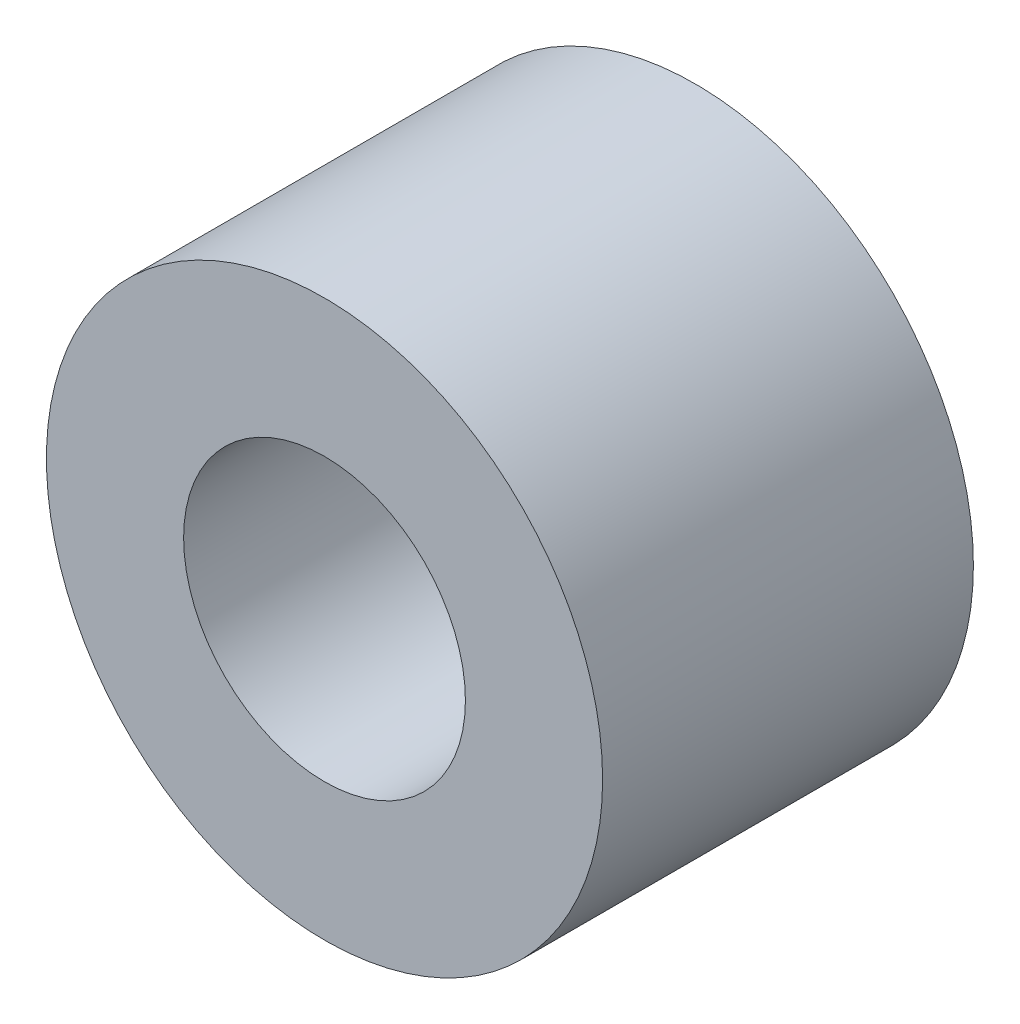
ISO-10303-21;
HEADER;
FILE_DESCRIPTION(('STEP AP214'),'2;1');
FILE_NAME('part.step','',(''),(''),'','','');
FILE_SCHEMA(('AUTOMOTIVE_DESIGN { 1 0 10303 214 1 1 1 1 }'));
ENDSEC;
DATA;
#1=APPLICATION_CONTEXT('core data for automotive mechanical design processes');
#2=APPLICATION_PROTOCOL_DEFINITION('international standard','automotive_design',2000,#1);
#3=PRODUCT_CONTEXT('',#1,'mechanical');
#4=PRODUCT('Part','Part','',(#3));
#5=PRODUCT_RELATED_PRODUCT_CATEGORY('part','',(#4));
#6=PRODUCT_DEFINITION_FORMATION('','',#4);
#7=PRODUCT_DEFINITION_CONTEXT('part definition',#1,'design');
#8=PRODUCT_DEFINITION('design','',#6,#7);
#9=PRODUCT_DEFINITION_SHAPE('','',#8);
#10=(LENGTH_UNIT() NAMED_UNIT(*) SI_UNIT(.MILLI.,.METRE.));
#11=(NAMED_UNIT(*) PLANE_ANGLE_UNIT() SI_UNIT($,.RADIAN.));
#12=(NAMED_UNIT(*) SI_UNIT($,.STERADIAN.) SOLID_ANGLE_UNIT());
#13=UNCERTAINTY_MEASURE_WITH_UNIT(LENGTH_MEASURE(1.E-05),#10,'distance_accuracy_value','');
#14=(GEOMETRIC_REPRESENTATION_CONTEXT(3) GLOBAL_UNCERTAINTY_ASSIGNED_CONTEXT((#13)) GLOBAL_UNIT_ASSIGNED_CONTEXT((#10,
#11,#12)) REPRESENTATION_CONTEXT('',''));
#15=CARTESIAN_POINT('',(0.,0.,0.));
#16=DIRECTION('',(0.,0.,1.));
#17=DIRECTION('',(1.,0.,0.));
#18=AXIS2_PLACEMENT_3D('',#15,#16,#17);
#19=CARTESIAN_POINT('',(0.,0.,6.35));
#20=DIRECTION('',(0.,0.,1.));
#21=DIRECTION('',(1.,0.,0.));
#22=AXIS2_PLACEMENT_3D('',#19,#20,#21);
#23=PLANE('',#22);
#24=CARTESIAN_POINT('',(0.,0.,6.35));
#25=DIRECTION('',(0.,0.,1.));
#26=DIRECTION('',(1.,0.,0.));
#27=AXIS2_PLACEMENT_3D('',#24,#25,#26);
#28=CIRCLE('',#27,9.525);
#29=CARTESIAN_POINT('',(9.525,0.,6.35));
#30=VERTEX_POINT('',#29);
#31=EDGE_CURVE('E10',#30,#30,#28,.T.);
#32=ORIENTED_EDGE('',*,*,#31,.T.);
#33=EDGE_LOOP('',(#32));
#34=FACE_BOUND('',#33,.T.);
#35=CARTESIAN_POINT('',(0.,0.,6.35));
#36=DIRECTION('',(0.,0.,1.));
#37=DIRECTION('',(1.,0.,0.));
#38=AXIS2_PLACEMENT_3D('',#35,#36,#37);
#39=CIRCLE('',#38,4.826);
#40=CARTESIAN_POINT('',(4.826,0.,6.35));
#41=VERTEX_POINT('',#40);
#42=EDGE_CURVE('E37',#41,#41,#39,.T.);
#43=ORIENTED_EDGE('',*,*,#42,.F.);
#44=EDGE_LOOP('',(#43));
#45=FACE_BOUND('',#44,.T.);
#46=ADVANCED_FACE('F30',(#34,#45),#23,.T.);
#47=CARTESIAN_POINT('',(0.,0.,6.35));
#48=DIRECTION('',(0.,0.,-1.));
#49=DIRECTION('',(-1.,0.,0.));
#50=AXIS2_PLACEMENT_3D('',#47,#48,#49);
#51=CYLINDRICAL_SURFACE('',#50,9.525);
#52=ORIENTED_EDGE('',*,*,#31,.F.);
#53=EDGE_LOOP('',(#52));
#54=FACE_BOUND('',#53,.T.);
#55=CARTESIAN_POINT('',(0.,0.,-6.35));
#56=DIRECTION('',(0.,0.,1.));
#57=DIRECTION('',(1.,0.,0.));
#58=AXIS2_PLACEMENT_3D('',#55,#56,#57);
#59=CIRCLE('',#58,9.525);
#60=CARTESIAN_POINT('',(9.525,0.,-6.35));
#61=VERTEX_POINT('',#60);
#62=EDGE_CURVE('E41',#61,#61,#59,.T.);
#63=ORIENTED_EDGE('',*,*,#62,.T.);
#64=EDGE_LOOP('',(#63));
#65=FACE_BOUND('',#64,.T.);
#66=ADVANCED_FACE('F32',(#54,#65),#51,.T.);
#67=CARTESIAN_POINT('',(0.,0.,6.35));
#68=DIRECTION('',(0.,0.,-1.));
#69=DIRECTION('',(-1.,0.,0.));
#70=AXIS2_PLACEMENT_3D('',#67,#68,#69);
#71=CYLINDRICAL_SURFACE('',#70,4.826);
#72=ORIENTED_EDGE('',*,*,#42,.T.);
#73=EDGE_LOOP('',(#72));
#74=FACE_BOUND('',#73,.T.);
#75=CARTESIAN_POINT('',(0.,0.,-6.35));
#76=DIRECTION('',(0.,0.,1.));
#77=DIRECTION('',(1.,0.,0.));
#78=AXIS2_PLACEMENT_3D('',#75,#76,#77);
#79=CIRCLE('',#78,4.826);
#80=CARTESIAN_POINT('',(4.826,0.,-6.35));
#81=VERTEX_POINT('',#80);
#82=EDGE_CURVE('E45',#81,#81,#79,.T.);
#83=ORIENTED_EDGE('',*,*,#82,.F.);
#84=EDGE_LOOP('',(#83));
#85=FACE_BOUND('',#84,.T.);
#86=ADVANCED_FACE('F54',(#74,#85),#71,.F.);
#87=CARTESIAN_POINT('',(0.,0.,-6.35));
#88=DIRECTION('',(0.,0.,1.));
#89=DIRECTION('',(1.,0.,0.));
#90=AXIS2_PLACEMENT_3D('',#87,#88,#89);
#91=PLANE('',#90);
#92=ORIENTED_EDGE('',*,*,#82,.T.);
#93=EDGE_LOOP('',(#92));
#94=FACE_BOUND('',#93,.T.);
#95=ORIENTED_EDGE('',*,*,#62,.F.);
#96=EDGE_LOOP('',(#95));
#97=FACE_BOUND('',#96,.T.);
#98=ADVANCED_FACE('F51',(#94,#97),#91,.F.);
#99=CLOSED_SHELL('',(#46,#66,#86,#98));
#100=MANIFOLD_SOLID_BREP('B2',#99);
#101=ADVANCED_BREP_SHAPE_REPRESENTATION('',(#18,#100),#14);
#102=SHAPE_DEFINITION_REPRESENTATION(#9,#101);
ENDSEC;
END-ISO-10303-21;
